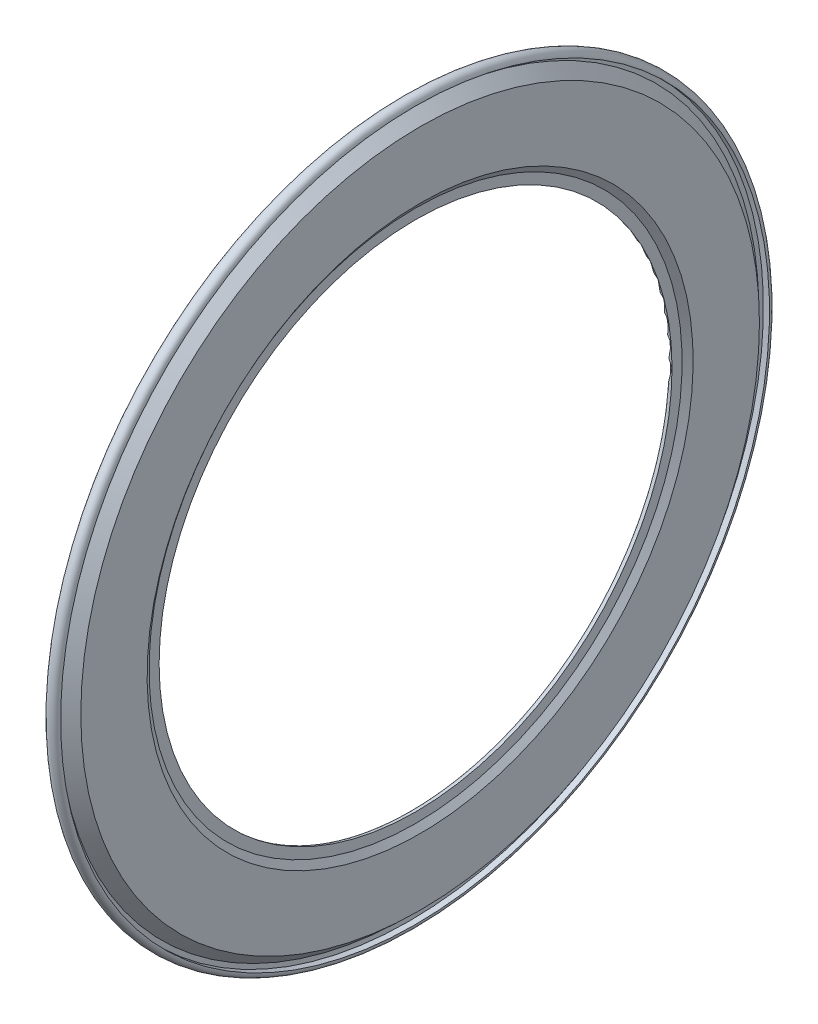
ISO-10303-21;
HEADER;
FILE_DESCRIPTION(('STEP AP214'),'2;1');
FILE_NAME('part.step','',(''),(''),'','','');
FILE_SCHEMA(('AUTOMOTIVE_DESIGN { 1 0 10303 214 1 1 1 1 }'));
ENDSEC;
DATA;
#1=APPLICATION_CONTEXT('core data for automotive mechanical design processes');
#2=APPLICATION_PROTOCOL_DEFINITION('international standard','automotive_design',2000,#1);
#3=PRODUCT_CONTEXT('',#1,'mechanical');
#4=PRODUCT('Part','Part','',(#3));
#5=PRODUCT_RELATED_PRODUCT_CATEGORY('part','',(#4));
#6=PRODUCT_DEFINITION_FORMATION('','',#4);
#7=PRODUCT_DEFINITION_CONTEXT('part definition',#1,'design');
#8=PRODUCT_DEFINITION('design','',#6,#7);
#9=PRODUCT_DEFINITION_SHAPE('','',#8);
#10=(LENGTH_UNIT() NAMED_UNIT(*) SI_UNIT(.MILLI.,.METRE.));
#11=(NAMED_UNIT(*) PLANE_ANGLE_UNIT() SI_UNIT($,.RADIAN.));
#12=(NAMED_UNIT(*) SI_UNIT($,.STERADIAN.) SOLID_ANGLE_UNIT());
#13=UNCERTAINTY_MEASURE_WITH_UNIT(LENGTH_MEASURE(1.E-05),#10,'distance_accuracy_value','');
#14=(GEOMETRIC_REPRESENTATION_CONTEXT(3) GLOBAL_UNCERTAINTY_ASSIGNED_CONTEXT((#13)) GLOBAL_UNIT_ASSIGNED_CONTEXT((#10,
#11,#12)) REPRESENTATION_CONTEXT('',''));
#15=CARTESIAN_POINT('',(0.,0.,0.));
#16=DIRECTION('',(0.,0.,1.));
#17=DIRECTION('',(1.,0.,0.));
#18=AXIS2_PLACEMENT_3D('',#15,#16,#17);
#19=CARTESIAN_POINT('',(6.755,10.600795,0.));
#20=DIRECTION('',(-1.,0.,0.));
#21=DIRECTION('',(0.,1.,0.));
#22=AXIS2_PLACEMENT_3D('',#19,#20,#21);
#23=PLANE('',#22);
#24=CARTESIAN_POINT('',(6.755,0.,0.));
#25=DIRECTION('',(-1.,0.,0.));
#26=DIRECTION('',(0.,1.,0.));
#27=AXIS2_PLACEMENT_3D('',#24,#25,#26);
#28=CIRCLE('',#27,11.74849);
#29=CARTESIAN_POINT('',(6.755,11.74849,0.));
#30=VERTEX_POINT('',#29);
#31=EDGE_CURVE('E11',#30,#30,#28,.T.);
#32=ORIENTED_EDGE('',*,*,#31,.T.);
#33=EDGE_LOOP('',(#32));
#34=FACE_BOUND('',#33,.T.);
#35=CARTESIAN_POINT('',(6.755,0.,0.));
#36=DIRECTION('',(-1.,0.,0.));
#37=DIRECTION('',(0.,1.,0.));
#38=AXIS2_PLACEMENT_3D('',#35,#36,#37);
#39=CIRCLE('',#38,9.4531);
#40=CARTESIAN_POINT('',(6.755,9.4531,0.));
#41=VERTEX_POINT('',#40);
#42=EDGE_CURVE('E74',#41,#41,#39,.T.);
#43=ORIENTED_EDGE('',*,*,#42,.F.);
#44=EDGE_LOOP('',(#43));
#45=FACE_BOUND('',#44,.T.);
#46=ADVANCED_FACE('F16',(#34,#45),#23,.T.);
#47=CARTESIAN_POINT('',(6.5625,0.,0.));
#48=DIRECTION('',(1.,0.,0.));
#49=DIRECTION('',(0.,1.,0.));
#50=AXIS2_PLACEMENT_3D('',#47,#48,#49);
#51=CYLINDRICAL_SURFACE('',#50,11.74849);
#52=CARTESIAN_POINT('',(6.37,0.,0.));
#53=DIRECTION('',(-1.,0.,0.));
#54=DIRECTION('',(0.,1.,0.));
#55=AXIS2_PLACEMENT_3D('',#52,#53,#54);
#56=CIRCLE('',#55,11.74849);
#57=CARTESIAN_POINT('',(6.37,11.74849,0.));
#58=VERTEX_POINT('',#57);
#59=EDGE_CURVE('E26',#58,#58,#56,.T.);
#60=ORIENTED_EDGE('',*,*,#59,.T.);
#61=EDGE_LOOP('',(#60));
#62=FACE_BOUND('',#61,.T.);
#63=ORIENTED_EDGE('',*,*,#31,.F.);
#64=EDGE_LOOP('',(#63));
#65=FACE_BOUND('',#64,.T.);
#66=ADVANCED_FACE('F108',(#62,#65),#51,.F.);
#67=CARTESIAN_POINT('',(6.37,12.010245,0.));
#68=DIRECTION('',(-1.,0.,0.));
#69=DIRECTION('',(0.,1.,0.));
#70=AXIS2_PLACEMENT_3D('',#67,#68,#69);
#71=PLANE('',#70);
#72=CARTESIAN_POINT('',(6.37,0.,0.));
#73=DIRECTION('',(-1.,0.,0.));
#74=DIRECTION('',(0.,1.,0.));
#75=AXIS2_PLACEMENT_3D('',#72,#73,#74);
#76=CIRCLE('',#75,12.272);
#77=CARTESIAN_POINT('',(6.37,12.272,0.));
#78=VERTEX_POINT('',#77);
#79=EDGE_CURVE('E82',#78,#78,#76,.T.);
#80=ORIENTED_EDGE('',*,*,#79,.T.);
#81=EDGE_LOOP('',(#80));
#82=FACE_BOUND('',#81,.T.);
#83=ORIENTED_EDGE('',*,*,#59,.F.);
#84=EDGE_LOOP('',(#83));
#85=FACE_BOUND('',#84,.T.);
#86=ADVANCED_FACE('F113',(#82,#85),#71,.T.);
#87=CARTESIAN_POINT('',(6.58,0.,0.));
#88=DIRECTION('',(-1.,0.,0.));
#89=DIRECTION('',(0.,0.,1.));
#90=AXIS2_PLACEMENT_3D('',#87,#88,#89);
#91=TOROIDAL_SURFACE('',#90,12.272,0.21);
#92=CARTESIAN_POINT('',(6.79,0.,0.));
#93=DIRECTION('',(-1.,0.,0.));
#94=DIRECTION('',(0.,1.,0.));
#95=AXIS2_PLACEMENT_3D('',#92,#93,#94);
#96=CIRCLE('',#95,12.272);
#97=CARTESIAN_POINT('',(6.79,12.272,0.));
#98=VERTEX_POINT('',#97);
#99=EDGE_CURVE('E20',#98,#98,#96,.T.);
#100=ORIENTED_EDGE('',*,*,#99,.T.);
#101=EDGE_LOOP('',(#100));
#102=FACE_BOUND('',#101,.T.);
#103=ORIENTED_EDGE('',*,*,#79,.F.);
#104=EDGE_LOOP('',(#103));
#105=FACE_BOUND('',#104,.T.);
#106=ADVANCED_FACE('F122',(#102,#105),#91,.T.);
#107=CARTESIAN_POINT('',(6.685,0.,0.));
#108=DIRECTION('',(1.,0.,0.));
#109=DIRECTION('',(0.,1.,0.));
#110=AXIS2_PLACEMENT_3D('',#107,#108,#109);
#111=CYLINDRICAL_SURFACE('',#110,12.272);
#112=CARTESIAN_POINT('',(6.58,0.,0.));
#113=DIRECTION('',(-1.,0.,0.));
#114=DIRECTION('',(0.,1.,0.));
#115=AXIS2_PLACEMENT_3D('',#112,#113,#114);
#116=CIRCLE('',#115,12.272);
#117=CARTESIAN_POINT('',(6.58,12.272,0.));
#118=VERTEX_POINT('',#117);
#119=EDGE_CURVE('E85',#118,#118,#116,.T.);
#120=ORIENTED_EDGE('',*,*,#119,.T.);
#121=EDGE_LOOP('',(#120));
#122=FACE_BOUND('',#121,.T.);
#123=ORIENTED_EDGE('',*,*,#99,.F.);
#124=EDGE_LOOP('',(#123));
#125=FACE_BOUND('',#124,.T.);
#126=ADVANCED_FACE('F124',(#122,#125),#111,.F.);
#127=CARTESIAN_POINT('',(6.58,12.19146,0.));
#128=DIRECTION('',(1.,0.,0.));
#129=DIRECTION('',(0.,-1.,0.));
#130=AXIS2_PLACEMENT_3D('',#127,#128,#129);
#131=PLANE('',#130);
#132=CARTESIAN_POINT('',(6.58,0.,0.));
#133=DIRECTION('',(-1.,0.,0.));
#134=DIRECTION('',(0.,1.,0.));
#135=AXIS2_PLACEMENT_3D('',#132,#133,#134);
#136=CIRCLE('',#135,12.11092);
#137=CARTESIAN_POINT('',(6.58,12.11092,0.));
#138=VERTEX_POINT('',#137);
#139=EDGE_CURVE('E80',#138,#138,#136,.T.);
#140=ORIENTED_EDGE('',*,*,#139,.T.);
#141=EDGE_LOOP('',(#140));
#142=FACE_BOUND('',#141,.T.);
#143=ORIENTED_EDGE('',*,*,#119,.F.);
#144=EDGE_LOOP('',(#143));
#145=FACE_BOUND('',#144,.T.);
#146=ADVANCED_FACE('F130',(#142,#145),#131,.T.);
#147=CARTESIAN_POINT('',(6.7725,0.,0.));
#148=DIRECTION('',(-1.,0.,0.));
#149=DIRECTION('',(0.,1.,0.));
#150=AXIS2_PLACEMENT_3D('',#147,#148,#149);
#151=CONICAL_SURFACE('',#150,11.929705,0.755210528942879);
#152=CARTESIAN_POINT('',(6.965,0.,0.));
#153=DIRECTION('',(-1.,0.,0.));
#154=DIRECTION('',(0.,1.,0.));
#155=AXIS2_PLACEMENT_3D('',#152,#153,#154);
#156=CIRCLE('',#155,11.74849);
#157=CARTESIAN_POINT('',(6.965,11.74849,0.));
#158=VERTEX_POINT('',#157);
#159=EDGE_CURVE('E77',#158,#158,#156,.T.);
#160=ORIENTED_EDGE('',*,*,#159,.T.);
#161=EDGE_LOOP('',(#160));
#162=FACE_BOUND('',#161,.T.);
#163=ORIENTED_EDGE('',*,*,#139,.F.);
#164=EDGE_LOOP('',(#163));
#165=FACE_BOUND('',#164,.T.);
#166=ADVANCED_FACE('F18',(#162,#165),#151,.T.);
#167=CARTESIAN_POINT('',(6.965,10.600795,0.));
#168=DIRECTION('',(1.,0.,0.));
#169=DIRECTION('',(0.,-1.,0.));
#170=AXIS2_PLACEMENT_3D('',#167,#168,#169);
#171=PLANE('',#170);
#172=CARTESIAN_POINT('',(6.965,0.,0.));
#173=DIRECTION('',(-1.,0.,0.));
#174=DIRECTION('',(0.,1.,0.));
#175=AXIS2_PLACEMENT_3D('',#172,#173,#174);
#176=CIRCLE('',#175,9.4531);
#177=CARTESIAN_POINT('',(6.965,9.4531,0.));
#178=VERTEX_POINT('',#177);
#179=EDGE_CURVE('E72',#178,#178,#176,.T.);
#180=ORIENTED_EDGE('',*,*,#179,.T.);
#181=EDGE_LOOP('',(#180));
#182=FACE_BOUND('',#181,.T.);
#183=ORIENTED_EDGE('',*,*,#159,.F.);
#184=EDGE_LOOP('',(#183));
#185=FACE_BOUND('',#184,.T.);
#186=ADVANCED_FACE('F91',(#182,#185),#171,.T.);
#187=CARTESIAN_POINT('',(6.88625,0.,0.));
#188=DIRECTION('',(1.,0.,0.));
#189=DIRECTION('',(0.,1.,0.));
#190=AXIS2_PLACEMENT_3D('',#187,#188,#189);
#191=CONICAL_SURFACE('',#190,9.34063334446906,0.959931088596881);
#192=CARTESIAN_POINT('',(6.8075,0.,0.));
#193=DIRECTION('',(-1.,0.,0.));
#194=DIRECTION('',(0.,1.,0.));
#195=AXIS2_PLACEMENT_3D('',#192,#193,#194);
#196=CIRCLE('',#195,9.22816668893812);
#197=CARTESIAN_POINT('',(6.8075,9.22816668893812,0.));
#198=VERTEX_POINT('',#197);
#199=EDGE_CURVE('E69',#198,#198,#196,.T.);
#200=ORIENTED_EDGE('',*,*,#199,.T.);
#201=EDGE_LOOP('',(#200));
#202=FACE_BOUND('',#201,.T.);
#203=ORIENTED_EDGE('',*,*,#179,.F.);
#204=EDGE_LOOP('',(#203));
#205=FACE_BOUND('',#204,.T.);
#206=ADVANCED_FACE('F94',(#202,#205),#191,.F.);
#207=CARTESIAN_POINT('',(6.8075,9.05389856296692,0.));
#208=DIRECTION('',(1.,0.,0.));
#209=DIRECTION('',(0.,-1.,0.));
#210=AXIS2_PLACEMENT_3D('',#207,#208,#209);
#211=PLANE('',#210);
#212=CARTESIAN_POINT('',(6.8075,0.,0.));
#213=DIRECTION('',(-1.,0.,0.));
#214=DIRECTION('',(0.,1.,0.));
#215=AXIS2_PLACEMENT_3D('',#212,#213,#214);
#216=CIRCLE('',#215,8.87963043699572);
#217=CARTESIAN_POINT('',(6.8075,8.87963043699572,0.));
#218=VERTEX_POINT('',#217);
#219=EDGE_CURVE('E65',#218,#218,#216,.T.);
#220=ORIENTED_EDGE('',*,*,#219,.T.);
#221=EDGE_LOOP('',(#220));
#222=FACE_BOUND('',#221,.T.);
#223=ORIENTED_EDGE('',*,*,#199,.F.);
#224=EDGE_LOOP('',(#223));
#225=FACE_BOUND('',#224,.T.);
#226=ADVANCED_FACE('F66',(#222,#225),#211,.T.);
#227=CARTESIAN_POINT('',(6.79,0.,0.));
#228=DIRECTION('',(-1.,0.,0.));
#229=DIRECTION('',(0.,0.,1.));
#230=AXIS2_PLACEMENT_3D('',#227,#228,#229);
#231=TOROIDAL_SURFACE('',#230,9.0889,0.21);
#232=CARTESIAN_POINT('',(6.58,0.,0.));
#233=DIRECTION('',(-1.,0.,0.));
#234=DIRECTION('',(0.,1.,0.));
#235=AXIS2_PLACEMENT_3D('',#232,#233,#234);
#236=CIRCLE('',#235,9.0889);
#237=CARTESIAN_POINT('',(6.58,9.0889,0.));
#238=VERTEX_POINT('',#237);
#239=EDGE_CURVE('E70',#238,#238,#236,.T.);
#240=ORIENTED_EDGE('',*,*,#239,.T.);
#241=EDGE_LOOP('',(#240));
#242=FACE_BOUND('',#241,.T.);
#243=ORIENTED_EDGE('',*,*,#219,.F.);
#244=EDGE_LOOP('',(#243));
#245=FACE_BOUND('',#244,.T.);
#246=ADVANCED_FACE('F103',(#242,#245),#231,.T.);
#247=CARTESIAN_POINT('',(6.58,9.14603704941007,0.));
#248=DIRECTION('',(-1.,0.,0.));
#249=DIRECTION('',(0.,1.,0.));
#250=AXIS2_PLACEMENT_3D('',#247,#248,#249);
#251=PLANE('',#250);
#252=CARTESIAN_POINT('',(6.58,0.,0.));
#253=DIRECTION('',(-1.,0.,0.));
#254=DIRECTION('',(0.,1.,0.));
#255=AXIS2_PLACEMENT_3D('',#252,#253,#254);
#256=CIRCLE('',#255,9.20317409882013);
#257=CARTESIAN_POINT('',(6.58,9.20317409882013,0.));
#258=VERTEX_POINT('',#257);
#259=EDGE_CURVE('E83',#258,#258,#256,.T.);
#260=ORIENTED_EDGE('',*,*,#259,.T.);
#261=EDGE_LOOP('',(#260));
#262=FACE_BOUND('',#261,.T.);
#263=ORIENTED_EDGE('',*,*,#239,.F.);
#264=EDGE_LOOP('',(#263));
#265=FACE_BOUND('',#264,.T.);
#266=ADVANCED_FACE('F118',(#262,#265),#251,.T.);
#267=CARTESIAN_POINT('',(6.6675,0.,0.));
#268=DIRECTION('',(1.,0.,0.));
#269=DIRECTION('',(0.,1.,0.));
#270=AXIS2_PLACEMENT_3D('',#267,#268,#269);
#271=CONICAL_SURFACE('',#270,9.32813704941006,0.959931088596879);
#272=ORIENTED_EDGE('',*,*,#42,.T.);
#273=EDGE_LOOP('',(#272));
#274=FACE_BOUND('',#273,.T.);
#275=ORIENTED_EDGE('',*,*,#259,.F.);
#276=EDGE_LOOP('',(#275));
#277=FACE_BOUND('',#276,.T.);
#278=ADVANCED_FACE('F120',(#274,#277),#271,.T.);
#279=CLOSED_SHELL('',(#46,#66,#86,#106,#126,#146,#166,#186,#206,#226,#246,#266,#278));
#280=MANIFOLD_SOLID_BREP('B1',#279);
#281=ADVANCED_BREP_SHAPE_REPRESENTATION('',(#18,#280),#14);
#282=SHAPE_DEFINITION_REPRESENTATION(#9,#281);
ENDSEC;
END-ISO-10303-21;
